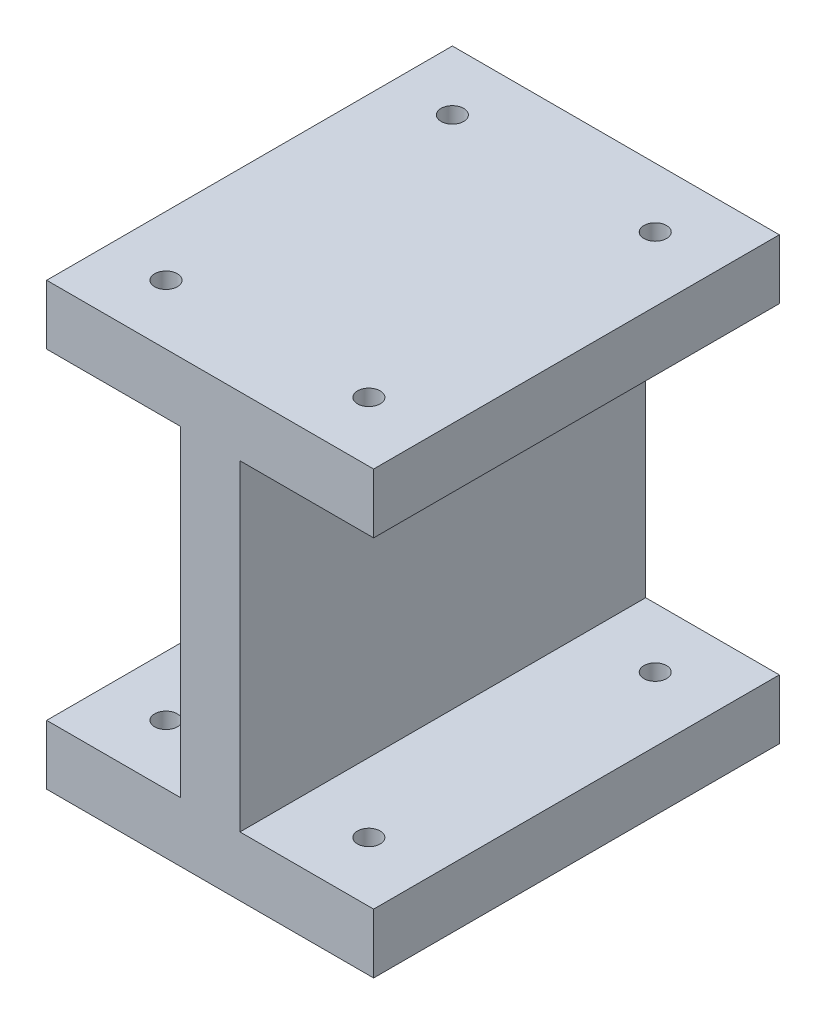
ISO-10303-21;
HEADER;
FILE_DESCRIPTION(('STEP AP214'),'2;1');
FILE_NAME('part.step','',(''),(''),'','','');
FILE_SCHEMA(('AUTOMOTIVE_DESIGN { 1 0 10303 214 1 1 1 1 }'));
ENDSEC;
DATA;
#1=APPLICATION_CONTEXT('core data for automotive mechanical design processes');
#2=APPLICATION_PROTOCOL_DEFINITION('international standard','automotive_design',2000,#1);
#3=PRODUCT_CONTEXT('',#1,'mechanical');
#4=PRODUCT('Part','Part','',(#3));
#5=PRODUCT_RELATED_PRODUCT_CATEGORY('part','',(#4));
#6=PRODUCT_DEFINITION_FORMATION('','',#4);
#7=PRODUCT_DEFINITION_CONTEXT('part definition',#1,'design');
#8=PRODUCT_DEFINITION('design','',#6,#7);
#9=PRODUCT_DEFINITION_SHAPE('','',#8);
#10=(LENGTH_UNIT() NAMED_UNIT(*) SI_UNIT(.MILLI.,.METRE.));
#11=(NAMED_UNIT(*) PLANE_ANGLE_UNIT() SI_UNIT($,.RADIAN.));
#12=(NAMED_UNIT(*) SI_UNIT($,.STERADIAN.) SOLID_ANGLE_UNIT());
#13=UNCERTAINTY_MEASURE_WITH_UNIT(LENGTH_MEASURE(1.E-05),#10,'distance_accuracy_value','');
#14=(GEOMETRIC_REPRESENTATION_CONTEXT(3) GLOBAL_UNCERTAINTY_ASSIGNED_CONTEXT((#13)) GLOBAL_UNIT_ASSIGNED_CONTEXT((#10,
#11,#12)) REPRESENTATION_CONTEXT('',''));
#15=CARTESIAN_POINT('',(0.,0.,0.));
#16=DIRECTION('',(0.,0.,1.));
#17=DIRECTION('',(1.,0.,0.));
#18=AXIS2_PLACEMENT_3D('',#15,#16,#17);
#19=CARTESIAN_POINT('',(0.,0.,-43.18));
#20=DIRECTION('',(-1.,0.,0.));
#21=DIRECTION('',(0.,0.,1.));
#22=AXIS2_PLACEMENT_3D('',#19,#20,#21);
#23=PLANE('',#22);
#24=DIRECTION('',(0.,0.,1.));
#25=VECTOR('',#24,1.);
#26=CARTESIAN_POINT('',(0.,40.5638,-43.18));
#27=LINE('',#26,#25);
#28=CARTESIAN_POINT('',(0.,40.5638,-43.18));
#29=VERTEX_POINT('',#28);
#30=CARTESIAN_POINT('',(0.,40.5638,0.));
#31=VERTEX_POINT('',#30);
#32=EDGE_CURVE('E215',#29,#31,#27,.T.);
#33=ORIENTED_EDGE('',*,*,#32,.T.);
#34=DIRECTION('',(0.,-1.,0.));
#35=VECTOR('',#34,1.);
#36=CARTESIAN_POINT('',(0.,0.,0.));
#37=LINE('',#36,#35);
#38=CARTESIAN_POINT('',(0.,46.9138,0.));
#39=VERTEX_POINT('',#38);
#40=EDGE_CURVE('E167',#39,#31,#37,.T.);
#41=ORIENTED_EDGE('',*,*,#40,.F.);
#42=DIRECTION('',(0.,0.,1.));
#43=VECTOR('',#42,1.);
#44=CARTESIAN_POINT('',(0.,46.9138,-43.18));
#45=LINE('',#44,#43);
#46=CARTESIAN_POINT('',(0.,46.9138,-43.18));
#47=VERTEX_POINT('',#46);
#48=EDGE_CURVE('E11',#47,#39,#45,.T.);
#49=ORIENTED_EDGE('',*,*,#48,.F.);
#50=DIRECTION('',(0.,-1.,0.));
#51=VECTOR('',#50,1.);
#52=CARTESIAN_POINT('',(0.,0.,-43.18));
#53=LINE('',#52,#51);
#54=EDGE_CURVE('E147',#47,#29,#53,.T.);
#55=ORIENTED_EDGE('',*,*,#54,.T.);
#56=EDGE_LOOP('',(#33,#41,#49,#55));
#57=FACE_BOUND('',#56,.T.);
#58=ADVANCED_FACE('F34',(#57),#23,.T.);
#59=CARTESIAN_POINT('',(34.798,0.,-43.18));
#60=DIRECTION('',(1.,0.,0.));
#61=DIRECTION('',(0.,0.,-1.));
#62=AXIS2_PLACEMENT_3D('',#59,#60,#61);
#63=PLANE('',#62);
#64=DIRECTION('',(0.,0.,1.));
#65=VECTOR('',#64,1.);
#66=CARTESIAN_POINT('',(34.798,40.5638,-43.18));
#67=LINE('',#66,#65);
#68=CARTESIAN_POINT('',(34.798,40.5638,-43.18));
#69=VERTEX_POINT('',#68);
#70=CARTESIAN_POINT('',(34.798,40.5638,0.));
#71=VERTEX_POINT('',#70);
#72=EDGE_CURVE('E237',#69,#71,#67,.T.);
#73=ORIENTED_EDGE('',*,*,#72,.F.);
#74=DIRECTION('',(0.,1.,0.));
#75=VECTOR('',#74,1.);
#76=CARTESIAN_POINT('',(34.798,0.,-43.18));
#77=LINE('',#76,#75);
#78=CARTESIAN_POINT('',(34.798,46.9138,-43.18));
#79=VERTEX_POINT('',#78);
#80=EDGE_CURVE('E159',#69,#79,#77,.T.);
#81=ORIENTED_EDGE('',*,*,#80,.T.);
#82=DIRECTION('',(0.,0.,1.));
#83=VECTOR('',#82,1.);
#84=CARTESIAN_POINT('',(34.798,46.9138,-43.18));
#85=LINE('',#84,#83);
#86=CARTESIAN_POINT('',(34.798,46.9138,0.));
#87=VERTEX_POINT('',#86);
#88=EDGE_CURVE('E43',#79,#87,#85,.T.);
#89=ORIENTED_EDGE('',*,*,#88,.T.);
#90=DIRECTION('',(0.,1.,0.));
#91=VECTOR('',#90,1.);
#92=CARTESIAN_POINT('',(34.798,0.,0.));
#93=LINE('',#92,#91);
#94=EDGE_CURVE('E173',#71,#87,#93,.T.);
#95=ORIENTED_EDGE('',*,*,#94,.F.);
#96=EDGE_LOOP('',(#73,#81,#89,#95));
#97=FACE_BOUND('',#96,.T.);
#98=ADVANCED_FACE('F263',(#97),#63,.T.);
#99=DIRECTION('',(0.,0.,1.));
#100=VECTOR('',#99,1.);
#101=CARTESIAN_POINT('',(0.,6.35,-43.18));
#102=LINE('',#101,#100);
#103=CARTESIAN_POINT('',(0.,6.35,-43.18));
#104=VERTEX_POINT('',#103);
#105=CARTESIAN_POINT('',(0.,6.35,0.));
#106=VERTEX_POINT('',#105);
#107=EDGE_CURVE('E59',#104,#106,#102,.T.);
#108=ORIENTED_EDGE('',*,*,#107,.F.);
#109=CARTESIAN_POINT('',(0.,0.,-43.18));
#110=VERTEX_POINT('',#109);
#111=EDGE_CURVE('E136',#104,#110,#53,.T.);
#112=ORIENTED_EDGE('',*,*,#111,.T.);
#113=DIRECTION('',(0.,0.,1.));
#114=VECTOR('',#113,1.);
#115=CARTESIAN_POINT('',(0.,0.,-43.18));
#116=LINE('',#115,#114);
#117=CARTESIAN_POINT('',(0.,0.,0.));
#118=VERTEX_POINT('',#117);
#119=EDGE_CURVE('E166',#110,#118,#116,.T.);
#120=ORIENTED_EDGE('',*,*,#119,.T.);
#121=EDGE_CURVE('E138',#106,#118,#37,.T.);
#122=ORIENTED_EDGE('',*,*,#121,.F.);
#123=EDGE_LOOP('',(#108,#112,#120,#122));
#124=FACE_BOUND('',#123,.T.);
#125=ADVANCED_FACE('F36',(#124),#23,.T.);
#126=CARTESIAN_POINT('',(0.,46.9138,-43.18));
#127=DIRECTION('',(0.,1.,0.));
#128=DIRECTION('',(0.,0.,1.));
#129=AXIS2_PLACEMENT_3D('',#126,#127,#128);
#130=PLANE('',#129);
#131=CARTESIAN_POINT('',(27.94,46.9138,-6.35));
#132=DIRECTION('',(0.,1.,0.));
#133=DIRECTION('',(0.,0.,1.));
#134=AXIS2_PLACEMENT_3D('',#131,#132,#133);
#135=CIRCLE('',#134,1.2065);
#136=CARTESIAN_POINT('',(27.94,46.9138,-5.1435));
#137=VERTEX_POINT('',#136);
#138=EDGE_CURVE('E350',#137,#137,#135,.T.);
#139=ORIENTED_EDGE('',*,*,#138,.F.);
#140=EDGE_LOOP('',(#139));
#141=FACE_BOUND('',#140,.T.);
#142=CARTESIAN_POINT('',(6.34999999999999,46.9138,-36.83));
#143=DIRECTION('',(0.,1.,0.));
#144=DIRECTION('',(0.,0.,1.));
#145=AXIS2_PLACEMENT_3D('',#142,#143,#144);
#146=CIRCLE('',#145,1.2065);
#147=CARTESIAN_POINT('',(6.34999999999999,46.9138,-35.6235));
#148=VERTEX_POINT('',#147);
#149=EDGE_CURVE('E339',#148,#148,#146,.T.);
#150=ORIENTED_EDGE('',*,*,#149,.F.);
#151=EDGE_LOOP('',(#150));
#152=FACE_BOUND('',#151,.T.);
#153=CARTESIAN_POINT('',(27.94,46.9138,-36.83));
#154=DIRECTION('',(0.,1.,0.));
#155=DIRECTION('',(0.,0.,1.));
#156=AXIS2_PLACEMENT_3D('',#153,#154,#155);
#157=CIRCLE('',#156,1.2065);
#158=CARTESIAN_POINT('',(27.94,46.9138,-35.6235));
#159=VERTEX_POINT('',#158);
#160=EDGE_CURVE('E340',#159,#159,#157,.T.);
#161=ORIENTED_EDGE('',*,*,#160,.F.);
#162=EDGE_LOOP('',(#161));
#163=FACE_BOUND('',#162,.T.);
#164=CARTESIAN_POINT('',(6.34999999999999,46.9138,-6.34999999999999));
#165=DIRECTION('',(0.,1.,0.));
#166=DIRECTION('',(0.,0.,1.));
#167=AXIS2_PLACEMENT_3D('',#164,#165,#166);
#168=CIRCLE('',#167,1.2065);
#169=CARTESIAN_POINT('',(6.34999999999999,46.9138,-5.14349999999999));
#170=VERTEX_POINT('',#169);
#171=EDGE_CURVE('E349',#170,#170,#168,.T.);
#172=ORIENTED_EDGE('',*,*,#171,.F.);
#173=EDGE_LOOP('',(#172));
#174=FACE_BOUND('',#173,.T.);
#175=DIRECTION('',(-1.,0.,0.));
#176=VECTOR('',#175,1.);
#177=CARTESIAN_POINT('',(0.,46.9138,0.));
#178=LINE('',#177,#176);
#179=EDGE_CURVE('E148',#87,#39,#178,.T.);
#180=ORIENTED_EDGE('',*,*,#179,.F.);
#181=ORIENTED_EDGE('',*,*,#88,.F.);
#182=DIRECTION('',(-1.,0.,0.));
#183=VECTOR('',#182,1.);
#184=CARTESIAN_POINT('',(0.,46.9138,-43.18));
#185=LINE('',#184,#183);
#186=EDGE_CURVE('E163',#79,#47,#185,.T.);
#187=ORIENTED_EDGE('',*,*,#186,.T.);
#188=ORIENTED_EDGE('',*,*,#48,.T.);
#189=EDGE_LOOP('',(#180,#181,#187,#188));
#190=FACE_BOUND('',#189,.T.);
#191=ADVANCED_FACE('F261',(#141,#152,#163,#174,#190),#130,.T.);
#192=DIRECTION('',(0.,0.,1.));
#193=VECTOR('',#192,1.);
#194=CARTESIAN_POINT('',(34.798,6.35,-43.18));
#195=LINE('',#194,#193);
#196=CARTESIAN_POINT('',(34.798,6.35,-43.18));
#197=VERTEX_POINT('',#196);
#198=CARTESIAN_POINT('',(34.798,6.35,0.));
#199=VERTEX_POINT('',#198);
#200=EDGE_CURVE('E238',#197,#199,#195,.T.);
#201=ORIENTED_EDGE('',*,*,#200,.T.);
#202=CARTESIAN_POINT('',(34.798,0.,0.));
#203=VERTEX_POINT('',#202);
#204=EDGE_CURVE('E152',#203,#199,#93,.T.);
#205=ORIENTED_EDGE('',*,*,#204,.F.);
#206=DIRECTION('',(0.,0.,1.));
#207=VECTOR('',#206,1.);
#208=CARTESIAN_POINT('',(34.798,0.,-43.18));
#209=LINE('',#208,#207);
#210=CARTESIAN_POINT('',(34.798,0.,-43.18));
#211=VERTEX_POINT('',#210);
#212=EDGE_CURVE('E178',#211,#203,#209,.T.);
#213=ORIENTED_EDGE('',*,*,#212,.F.);
#214=EDGE_CURVE('E160',#211,#197,#77,.T.);
#215=ORIENTED_EDGE('',*,*,#214,.T.);
#216=EDGE_LOOP('',(#201,#205,#213,#215));
#217=FACE_BOUND('',#216,.T.);
#218=ADVANCED_FACE('F251',(#217),#63,.T.);
#219=CARTESIAN_POINT('',(0.,0.,-43.18));
#220=DIRECTION('',(0.,-1.,0.));
#221=DIRECTION('',(0.,0.,-1.));
#222=AXIS2_PLACEMENT_3D('',#219,#220,#221);
#223=PLANE('',#222);
#224=CARTESIAN_POINT('',(27.94,0.,-6.35));
#225=DIRECTION('',(0.,1.,0.));
#226=DIRECTION('',(0.,0.,1.));
#227=AXIS2_PLACEMENT_3D('',#224,#225,#226);
#228=CIRCLE('',#227,1.2065);
#229=CARTESIAN_POINT('',(27.94,0.,-5.1435));
#230=VERTEX_POINT('',#229);
#231=EDGE_CURVE('E347',#230,#230,#228,.T.);
#232=ORIENTED_EDGE('',*,*,#231,.T.);
#233=EDGE_LOOP('',(#232));
#234=FACE_BOUND('',#233,.T.);
#235=CARTESIAN_POINT('',(6.34999999999999,0.,-36.83));
#236=DIRECTION('',(0.,1.,0.));
#237=DIRECTION('',(0.,0.,1.));
#238=AXIS2_PLACEMENT_3D('',#235,#236,#237);
#239=CIRCLE('',#238,1.2065);
#240=CARTESIAN_POINT('',(6.34999999999999,0.,-35.6235));
#241=VERTEX_POINT('',#240);
#242=EDGE_CURVE('E343',#241,#241,#239,.T.);
#243=ORIENTED_EDGE('',*,*,#242,.T.);
#244=EDGE_LOOP('',(#243));
#245=FACE_BOUND('',#244,.T.);
#246=CARTESIAN_POINT('',(27.94,0.,-36.83));
#247=DIRECTION('',(0.,1.,0.));
#248=DIRECTION('',(0.,0.,1.));
#249=AXIS2_PLACEMENT_3D('',#246,#247,#248);
#250=CIRCLE('',#249,1.2065);
#251=CARTESIAN_POINT('',(27.94,0.,-35.6235));
#252=VERTEX_POINT('',#251);
#253=EDGE_CURVE('E337',#252,#252,#250,.T.);
#254=ORIENTED_EDGE('',*,*,#253,.T.);
#255=EDGE_LOOP('',(#254));
#256=FACE_BOUND('',#255,.T.);
#257=CARTESIAN_POINT('',(6.34999999999999,0.,-6.34999999999999));
#258=DIRECTION('',(0.,1.,0.));
#259=DIRECTION('',(0.,0.,1.));
#260=AXIS2_PLACEMENT_3D('',#257,#258,#259);
#261=CIRCLE('',#260,1.2065);
#262=CARTESIAN_POINT('',(6.34999999999999,0.,-5.14349999999999));
#263=VERTEX_POINT('',#262);
#264=EDGE_CURVE('E185',#263,#263,#261,.T.);
#265=ORIENTED_EDGE('',*,*,#264,.T.);
#266=EDGE_LOOP('',(#265));
#267=FACE_BOUND('',#266,.T.);
#268=DIRECTION('',(1.,0.,0.));
#269=VECTOR('',#268,1.);
#270=CARTESIAN_POINT('',(0.,0.,0.));
#271=LINE('',#270,#269);
#272=EDGE_CURVE('E170',#118,#203,#271,.T.);
#273=ORIENTED_EDGE('',*,*,#272,.F.);
#274=ORIENTED_EDGE('',*,*,#119,.F.);
#275=DIRECTION('',(1.,0.,0.));
#276=VECTOR('',#275,1.);
#277=CARTESIAN_POINT('',(0.,0.,-43.18));
#278=LINE('',#277,#276);
#279=EDGE_CURVE('E146',#110,#211,#278,.T.);
#280=ORIENTED_EDGE('',*,*,#279,.T.);
#281=ORIENTED_EDGE('',*,*,#212,.T.);
#282=EDGE_LOOP('',(#273,#274,#280,#281));
#283=FACE_BOUND('',#282,.T.);
#284=ADVANCED_FACE('F253',(#234,#245,#256,#267,#283),#223,.T.);
#285=CARTESIAN_POINT('',(0.,0.,-43.18));
#286=DIRECTION('',(0.,0.,-1.));
#287=DIRECTION('',(-1.,0.,0.));
#288=AXIS2_PLACEMENT_3D('',#285,#286,#287);
#289=PLANE('',#288);
#290=DIRECTION('',(-1.,0.,0.));
#291=VECTOR('',#290,1.);
#292=CARTESIAN_POINT('',(0.,40.5638,-43.18));
#293=LINE('',#292,#291);
#294=CARTESIAN_POINT('',(14.224,40.5638,-43.18));
#295=VERTEX_POINT('',#294);
#296=EDGE_CURVE('E139',#295,#29,#293,.T.);
#297=ORIENTED_EDGE('',*,*,#296,.T.);
#298=ORIENTED_EDGE('',*,*,#54,.F.);
#299=ORIENTED_EDGE('',*,*,#186,.F.);
#300=ORIENTED_EDGE('',*,*,#80,.F.);
#301=DIRECTION('',(-1.,0.,0.));
#302=VECTOR('',#301,1.);
#303=CARTESIAN_POINT('',(20.574,40.5638,-43.18));
#304=LINE('',#303,#302);
#305=CARTESIAN_POINT('',(20.574,40.5638,-43.18));
#306=VERTEX_POINT('',#305);
#307=EDGE_CURVE('E228',#69,#306,#304,.T.);
#308=ORIENTED_EDGE('',*,*,#307,.T.);
#309=DIRECTION('',(0.,-1.,0.));
#310=VECTOR('',#309,1.);
#311=CARTESIAN_POINT('',(20.574,40.5638,-43.18));
#312=LINE('',#311,#310);
#313=CARTESIAN_POINT('',(20.574,6.35,-43.18));
#314=VERTEX_POINT('',#313);
#315=EDGE_CURVE('E221',#306,#314,#312,.T.);
#316=ORIENTED_EDGE('',*,*,#315,.T.);
#317=DIRECTION('',(1.,0.,0.));
#318=VECTOR('',#317,1.);
#319=CARTESIAN_POINT('',(20.574,6.35,-43.18));
#320=LINE('',#319,#318);
#321=EDGE_CURVE('E224',#314,#197,#320,.T.);
#322=ORIENTED_EDGE('',*,*,#321,.T.);
#323=ORIENTED_EDGE('',*,*,#214,.F.);
#324=ORIENTED_EDGE('',*,*,#279,.F.);
#325=ORIENTED_EDGE('',*,*,#111,.F.);
#326=DIRECTION('',(1.,0.,0.));
#327=VECTOR('',#326,1.);
#328=CARTESIAN_POINT('',(0.,6.35,-43.18));
#329=LINE('',#328,#327);
#330=CARTESIAN_POINT('',(14.224,6.35,-43.18));
#331=VERTEX_POINT('',#330);
#332=EDGE_CURVE('E123',#104,#331,#329,.T.);
#333=ORIENTED_EDGE('',*,*,#332,.T.);
#334=DIRECTION('',(0.,1.,0.));
#335=VECTOR('',#334,1.);
#336=CARTESIAN_POINT('',(14.224,6.35,-43.18));
#337=LINE('',#336,#335);
#338=EDGE_CURVE('E130',#331,#295,#337,.T.);
#339=ORIENTED_EDGE('',*,*,#338,.T.);
#340=EDGE_LOOP('',(#297,#298,#299,#300,#308,#316,#322,#323,#324,#325,#333,#339));
#341=FACE_BOUND('',#340,.T.);
#342=ADVANCED_FACE('F143',(#341),#289,.T.);
#343=CARTESIAN_POINT('',(0.,0.,0.));
#344=DIRECTION('',(0.,0.,-1.));
#345=DIRECTION('',(-1.,0.,0.));
#346=AXIS2_PLACEMENT_3D('',#343,#344,#345);
#347=PLANE('',#346);
#348=ORIENTED_EDGE('',*,*,#40,.T.);
#349=DIRECTION('',(-1.,0.,0.));
#350=VECTOR('',#349,1.);
#351=CARTESIAN_POINT('',(0.,40.5638,0.));
#352=LINE('',#351,#350);
#353=CARTESIAN_POINT('',(14.224,40.5638,0.));
#354=VERTEX_POINT('',#353);
#355=EDGE_CURVE('E131',#354,#31,#352,.T.);
#356=ORIENTED_EDGE('',*,*,#355,.F.);
#357=DIRECTION('',(0.,1.,0.));
#358=VECTOR('',#357,1.);
#359=CARTESIAN_POINT('',(14.224,6.35,0.));
#360=LINE('',#359,#358);
#361=CARTESIAN_POINT('',(14.224,6.35,0.));
#362=VERTEX_POINT('',#361);
#363=EDGE_CURVE('E210',#362,#354,#360,.T.);
#364=ORIENTED_EDGE('',*,*,#363,.F.);
#365=DIRECTION('',(1.,0.,0.));
#366=VECTOR('',#365,1.);
#367=CARTESIAN_POINT('',(0.,6.35,0.));
#368=LINE('',#367,#366);
#369=EDGE_CURVE('E208',#106,#362,#368,.T.);
#370=ORIENTED_EDGE('',*,*,#369,.F.);
#371=ORIENTED_EDGE('',*,*,#121,.T.);
#372=ORIENTED_EDGE('',*,*,#272,.T.);
#373=ORIENTED_EDGE('',*,*,#204,.T.);
#374=DIRECTION('',(1.,0.,0.));
#375=VECTOR('',#374,1.);
#376=CARTESIAN_POINT('',(20.574,6.35,0.));
#377=LINE('',#376,#375);
#378=CARTESIAN_POINT('',(20.574,6.35,0.));
#379=VERTEX_POINT('',#378);
#380=EDGE_CURVE('E232',#379,#199,#377,.T.);
#381=ORIENTED_EDGE('',*,*,#380,.F.);
#382=DIRECTION('',(0.,-1.,0.));
#383=VECTOR('',#382,1.);
#384=CARTESIAN_POINT('',(20.574,40.5638,0.));
#385=LINE('',#384,#383);
#386=CARTESIAN_POINT('',(20.574,40.5638,0.));
#387=VERTEX_POINT('',#386);
#388=EDGE_CURVE('E51',#387,#379,#385,.T.);
#389=ORIENTED_EDGE('',*,*,#388,.F.);
#390=DIRECTION('',(-1.,0.,0.));
#391=VECTOR('',#390,1.);
#392=CARTESIAN_POINT('',(20.574,40.5638,0.));
#393=LINE('',#392,#391);
#394=EDGE_CURVE('E225',#71,#387,#393,.T.);
#395=ORIENTED_EDGE('',*,*,#394,.F.);
#396=ORIENTED_EDGE('',*,*,#94,.T.);
#397=ORIENTED_EDGE('',*,*,#179,.T.);
#398=EDGE_LOOP('',(#348,#356,#364,#370,#371,#372,#373,#381,#389,#395,#396,#397));
#399=FACE_BOUND('',#398,.T.);
#400=ADVANCED_FACE('F248',(#399),#347,.F.);
#401=CARTESIAN_POINT('',(20.574,40.5638,-43.18));
#402=DIRECTION('',(-1.,0.,0.));
#403=DIRECTION('',(0.,0.,1.));
#404=AXIS2_PLACEMENT_3D('',#401,#402,#403);
#405=PLANE('',#404);
#406=ORIENTED_EDGE('',*,*,#388,.T.);
#407=DIRECTION('',(0.,0.,1.));
#408=VECTOR('',#407,1.);
#409=CARTESIAN_POINT('',(20.574,6.35,-43.18));
#410=LINE('',#409,#408);
#411=EDGE_CURVE('E156',#314,#379,#410,.T.);
#412=ORIENTED_EDGE('',*,*,#411,.F.);
#413=ORIENTED_EDGE('',*,*,#315,.F.);
#414=DIRECTION('',(0.,0.,1.));
#415=VECTOR('',#414,1.);
#416=CARTESIAN_POINT('',(20.574,40.5638,-43.18));
#417=LINE('',#416,#415);
#418=EDGE_CURVE('E211',#306,#387,#417,.T.);
#419=ORIENTED_EDGE('',*,*,#418,.T.);
#420=EDGE_LOOP('',(#406,#412,#413,#419));
#421=FACE_BOUND('',#420,.T.);
#422=ADVANCED_FACE('F284',(#421),#405,.F.);
#423=CARTESIAN_POINT('',(20.574,40.5638,-43.18));
#424=DIRECTION('',(0.,1.,0.));
#425=DIRECTION('',(0.,0.,1.));
#426=AXIS2_PLACEMENT_3D('',#423,#424,#425);
#427=PLANE('',#426);
#428=CARTESIAN_POINT('',(27.94,40.5638,-6.35));
#429=DIRECTION('',(0.,1.,0.));
#430=DIRECTION('',(0.,0.,1.));
#431=AXIS2_PLACEMENT_3D('',#428,#429,#430);
#432=CIRCLE('',#431,1.2065);
#433=CARTESIAN_POINT('',(27.94,40.5638,-5.1435));
#434=VERTEX_POINT('',#433);
#435=EDGE_CURVE('E203',#434,#434,#432,.T.);
#436=ORIENTED_EDGE('',*,*,#435,.T.);
#437=EDGE_LOOP('',(#436));
#438=FACE_BOUND('',#437,.T.);
#439=CARTESIAN_POINT('',(27.94,40.5638,-36.83));
#440=DIRECTION('',(0.,1.,0.));
#441=DIRECTION('',(0.,0.,1.));
#442=AXIS2_PLACEMENT_3D('',#439,#440,#441);
#443=CIRCLE('',#442,1.2065);
#444=CARTESIAN_POINT('',(27.94,40.5638,-35.6235));
#445=VERTEX_POINT('',#444);
#446=EDGE_CURVE('E191',#445,#445,#443,.T.);
#447=ORIENTED_EDGE('',*,*,#446,.T.);
#448=EDGE_LOOP('',(#447));
#449=FACE_BOUND('',#448,.T.);
#450=ORIENTED_EDGE('',*,*,#394,.T.);
#451=ORIENTED_EDGE('',*,*,#418,.F.);
#452=ORIENTED_EDGE('',*,*,#307,.F.);
#453=ORIENTED_EDGE('',*,*,#72,.T.);
#454=EDGE_LOOP('',(#450,#451,#452,#453));
#455=FACE_BOUND('',#454,.T.);
#456=ADVANCED_FACE('F288',(#438,#449,#455),#427,.F.);
#457=CARTESIAN_POINT('',(20.574,6.35,-43.18));
#458=DIRECTION('',(0.,-1.,0.));
#459=DIRECTION('',(0.,0.,-1.));
#460=AXIS2_PLACEMENT_3D('',#457,#458,#459);
#461=PLANE('',#460);
#462=CARTESIAN_POINT('',(27.94,6.35,-6.35));
#463=DIRECTION('',(0.,-1.,0.));
#464=DIRECTION('',(0.,0.,-1.));
#465=AXIS2_PLACEMENT_3D('',#462,#463,#464);
#466=CIRCLE('',#465,1.2065);
#467=CARTESIAN_POINT('',(27.94,6.35,-7.5565));
#468=VERTEX_POINT('',#467);
#469=EDGE_CURVE('E38',#468,#468,#466,.T.);
#470=ORIENTED_EDGE('',*,*,#469,.T.);
#471=EDGE_LOOP('',(#470));
#472=FACE_BOUND('',#471,.T.);
#473=CARTESIAN_POINT('',(27.94,6.35,-36.83));
#474=DIRECTION('',(0.,-1.,0.));
#475=DIRECTION('',(0.,0.,-1.));
#476=AXIS2_PLACEMENT_3D('',#473,#474,#475);
#477=CIRCLE('',#476,1.2065);
#478=CARTESIAN_POINT('',(27.94,6.35,-38.0365));
#479=VERTEX_POINT('',#478);
#480=EDGE_CURVE('E189',#479,#479,#477,.T.);
#481=ORIENTED_EDGE('',*,*,#480,.T.);
#482=EDGE_LOOP('',(#481));
#483=FACE_BOUND('',#482,.T.);
#484=ORIENTED_EDGE('',*,*,#380,.T.);
#485=ORIENTED_EDGE('',*,*,#200,.F.);
#486=ORIENTED_EDGE('',*,*,#321,.F.);
#487=ORIENTED_EDGE('',*,*,#411,.T.);
#488=EDGE_LOOP('',(#484,#485,#486,#487));
#489=FACE_BOUND('',#488,.T.);
#490=ADVANCED_FACE('F245',(#472,#483,#489),#461,.F.);
#491=CARTESIAN_POINT('',(0.,40.5638,-43.18));
#492=DIRECTION('',(0.,1.,0.));
#493=DIRECTION('',(0.,0.,1.));
#494=AXIS2_PLACEMENT_3D('',#491,#492,#493);
#495=PLANE('',#494);
#496=CARTESIAN_POINT('',(6.34999999999999,40.5638,-36.83));
#497=DIRECTION('',(0.,1.,0.));
#498=DIRECTION('',(0.,0.,1.));
#499=AXIS2_PLACEMENT_3D('',#496,#497,#498);
#500=CIRCLE('',#499,1.2065);
#501=CARTESIAN_POINT('',(6.34999999999999,40.5638,-35.6235));
#502=VERTEX_POINT('',#501);
#503=EDGE_CURVE('E188',#502,#502,#500,.T.);
#504=ORIENTED_EDGE('',*,*,#503,.T.);
#505=EDGE_LOOP('',(#504));
#506=FACE_BOUND('',#505,.T.);
#507=CARTESIAN_POINT('',(6.34999999999999,40.5638,-6.34999999999999));
#508=DIRECTION('',(0.,1.,0.));
#509=DIRECTION('',(0.,0.,1.));
#510=AXIS2_PLACEMENT_3D('',#507,#508,#509);
#511=CIRCLE('',#510,1.2065);
#512=CARTESIAN_POINT('',(6.34999999999999,40.5638,-5.14349999999999));
#513=VERTEX_POINT('',#512);
#514=EDGE_CURVE('E184',#513,#513,#511,.T.);
#515=ORIENTED_EDGE('',*,*,#514,.T.);
#516=EDGE_LOOP('',(#515));
#517=FACE_BOUND('',#516,.T.);
#518=ORIENTED_EDGE('',*,*,#355,.T.);
#519=ORIENTED_EDGE('',*,*,#32,.F.);
#520=ORIENTED_EDGE('',*,*,#296,.F.);
#521=DIRECTION('',(0.,0.,1.));
#522=VECTOR('',#521,1.);
#523=CARTESIAN_POINT('',(14.224,40.5638,-43.18));
#524=LINE('',#523,#522);
#525=EDGE_CURVE('E218',#295,#354,#524,.T.);
#526=ORIENTED_EDGE('',*,*,#525,.T.);
#527=EDGE_LOOP('',(#518,#519,#520,#526));
#528=FACE_BOUND('',#527,.T.);
#529=ADVANCED_FACE('F291',(#506,#517,#528),#495,.F.);
#530=CARTESIAN_POINT('',(14.224,6.35,-43.18));
#531=DIRECTION('',(1.,0.,0.));
#532=DIRECTION('',(0.,0.,-1.));
#533=AXIS2_PLACEMENT_3D('',#530,#531,#532);
#534=PLANE('',#533);
#535=ORIENTED_EDGE('',*,*,#363,.T.);
#536=ORIENTED_EDGE('',*,*,#525,.F.);
#537=ORIENTED_EDGE('',*,*,#338,.F.);
#538=DIRECTION('',(0.,0.,1.));
#539=VECTOR('',#538,1.);
#540=CARTESIAN_POINT('',(14.224,6.35,-43.18));
#541=LINE('',#540,#539);
#542=EDGE_CURVE('E125',#331,#362,#541,.T.);
#543=ORIENTED_EDGE('',*,*,#542,.T.);
#544=EDGE_LOOP('',(#535,#536,#537,#543));
#545=FACE_BOUND('',#544,.T.);
#546=ADVANCED_FACE('F299',(#545),#534,.F.);
#547=CARTESIAN_POINT('',(0.,6.35,-43.18));
#548=DIRECTION('',(0.,-1.,0.));
#549=DIRECTION('',(1.,0.,0.));
#550=AXIS2_PLACEMENT_3D('',#547,#548,#549);
#551=PLANE('',#550);
#552=CARTESIAN_POINT('',(6.34999999999999,6.35,-36.83));
#553=DIRECTION('',(0.,-1.,0.));
#554=DIRECTION('',(1.,0.,0.));
#555=AXIS2_PLACEMENT_3D('',#552,#553,#554);
#556=CIRCLE('',#555,1.2065);
#557=CARTESIAN_POINT('',(7.55649999999999,6.35,-36.83));
#558=VERTEX_POINT('',#557);
#559=EDGE_CURVE('E186',#558,#558,#556,.T.);
#560=ORIENTED_EDGE('',*,*,#559,.T.);
#561=EDGE_LOOP('',(#560));
#562=FACE_BOUND('',#561,.T.);
#563=CARTESIAN_POINT('',(6.34999999999999,6.35,-6.34999999999999));
#564=DIRECTION('',(0.,-1.,0.));
#565=DIRECTION('',(1.,0.,0.));
#566=AXIS2_PLACEMENT_3D('',#563,#564,#565);
#567=CIRCLE('',#566,1.2065);
#568=CARTESIAN_POINT('',(7.55649999999999,6.35,-6.34999999999999));
#569=VERTEX_POINT('',#568);
#570=EDGE_CURVE('E181',#569,#569,#567,.T.);
#571=ORIENTED_EDGE('',*,*,#570,.T.);
#572=EDGE_LOOP('',(#571));
#573=FACE_BOUND('',#572,.T.);
#574=ORIENTED_EDGE('',*,*,#369,.T.);
#575=ORIENTED_EDGE('',*,*,#542,.F.);
#576=ORIENTED_EDGE('',*,*,#332,.F.);
#577=ORIENTED_EDGE('',*,*,#107,.T.);
#578=EDGE_LOOP('',(#574,#575,#576,#577));
#579=FACE_BOUND('',#578,.T.);
#580=ADVANCED_FACE('F124',(#562,#573,#579),#551,.F.);
#581=CARTESIAN_POINT('',(6.34999999999999,0.,-6.34999999999999));
#582=DIRECTION('',(0.,1.,0.));
#583=DIRECTION('',(0.,0.,1.));
#584=AXIS2_PLACEMENT_3D('',#581,#582,#583);
#585=CYLINDRICAL_SURFACE('',#584,1.2065);
#586=ORIENTED_EDGE('',*,*,#264,.F.);
#587=EDGE_LOOP('',(#586));
#588=FACE_BOUND('',#587,.T.);
#589=ORIENTED_EDGE('',*,*,#570,.F.);
#590=EDGE_LOOP('',(#589));
#591=FACE_BOUND('',#590,.T.);
#592=ADVANCED_FACE('F298',(#588,#591),#585,.F.);
#593=CARTESIAN_POINT('',(6.34999999999999,0.,-36.83));
#594=DIRECTION('',(0.,1.,0.));
#595=DIRECTION('',(0.,0.,1.));
#596=AXIS2_PLACEMENT_3D('',#593,#594,#595);
#597=CYLINDRICAL_SURFACE('',#596,1.2065);
#598=ORIENTED_EDGE('',*,*,#242,.F.);
#599=EDGE_LOOP('',(#598));
#600=FACE_BOUND('',#599,.T.);
#601=ORIENTED_EDGE('',*,*,#559,.F.);
#602=EDGE_LOOP('',(#601));
#603=FACE_BOUND('',#602,.T.);
#604=ADVANCED_FACE('F310',(#600,#603),#597,.F.);
#605=ORIENTED_EDGE('',*,*,#171,.T.);
#606=EDGE_LOOP('',(#605));
#607=FACE_BOUND('',#606,.T.);
#608=ORIENTED_EDGE('',*,*,#514,.F.);
#609=EDGE_LOOP('',(#608));
#610=FACE_BOUND('',#609,.T.);
#611=ADVANCED_FACE('F306',(#607,#610),#585,.F.);
#612=ORIENTED_EDGE('',*,*,#149,.T.);
#613=EDGE_LOOP('',(#612));
#614=FACE_BOUND('',#613,.T.);
#615=ORIENTED_EDGE('',*,*,#503,.F.);
#616=EDGE_LOOP('',(#615));
#617=FACE_BOUND('',#616,.T.);
#618=ADVANCED_FACE('F309',(#614,#617),#597,.F.);
#619=CARTESIAN_POINT('',(27.94,0.,-36.83));
#620=DIRECTION('',(0.,1.,0.));
#621=DIRECTION('',(0.,0.,1.));
#622=AXIS2_PLACEMENT_3D('',#619,#620,#621);
#623=CYLINDRICAL_SURFACE('',#622,1.2065);
#624=ORIENTED_EDGE('',*,*,#253,.F.);
#625=EDGE_LOOP('',(#624));
#626=FACE_BOUND('',#625,.T.);
#627=ORIENTED_EDGE('',*,*,#480,.F.);
#628=EDGE_LOOP('',(#627));
#629=FACE_BOUND('',#628,.T.);
#630=ADVANCED_FACE('F314',(#626,#629),#623,.F.);
#631=CARTESIAN_POINT('',(27.94,0.,-6.35));
#632=DIRECTION('',(0.,1.,0.));
#633=DIRECTION('',(0.,0.,1.));
#634=AXIS2_PLACEMENT_3D('',#631,#632,#633);
#635=CYLINDRICAL_SURFACE('',#634,1.2065);
#636=ORIENTED_EDGE('',*,*,#231,.F.);
#637=EDGE_LOOP('',(#636));
#638=FACE_BOUND('',#637,.T.);
#639=ORIENTED_EDGE('',*,*,#469,.F.);
#640=EDGE_LOOP('',(#639));
#641=FACE_BOUND('',#640,.T.);
#642=ADVANCED_FACE('F321',(#638,#641),#635,.F.);
#643=ORIENTED_EDGE('',*,*,#160,.T.);
#644=EDGE_LOOP('',(#643));
#645=FACE_BOUND('',#644,.T.);
#646=ORIENTED_EDGE('',*,*,#446,.F.);
#647=EDGE_LOOP('',(#646));
#648=FACE_BOUND('',#647,.T.);
#649=ADVANCED_FACE('F319',(#645,#648),#623,.F.);
#650=ORIENTED_EDGE('',*,*,#138,.T.);
#651=EDGE_LOOP('',(#650));
#652=FACE_BOUND('',#651,.T.);
#653=ORIENTED_EDGE('',*,*,#435,.F.);
#654=EDGE_LOOP('',(#653));
#655=FACE_BOUND('',#654,.T.);
#656=ADVANCED_FACE('F316',(#652,#655),#635,.F.);
#657=CLOSED_SHELL('',(#58,#98,#125,#191,#218,#284,#342,#400,#422,#456,#490,#529,#546,#580,#592,
#604,#611,#618,#630,#642,#649,#656));
#658=MANIFOLD_SOLID_BREP('B2',#657);
#659=ADVANCED_BREP_SHAPE_REPRESENTATION('',(#18,#658),#14);
#660=SHAPE_DEFINITION_REPRESENTATION(#9,#659);
ENDSEC;
END-ISO-10303-21;
